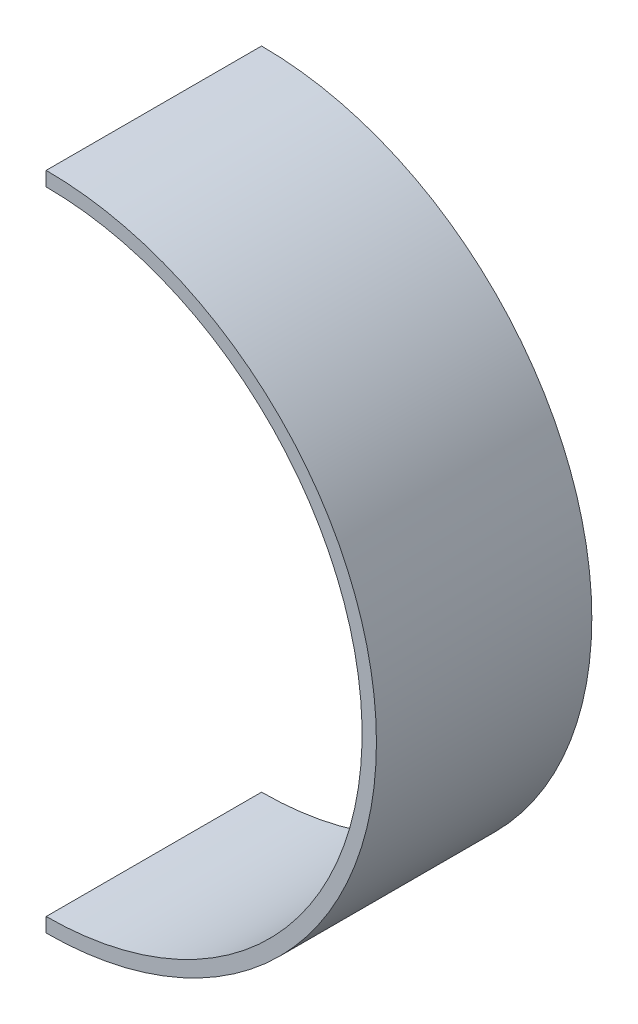
ISO-10303-21;
HEADER;
FILE_DESCRIPTION(('STEP AP214'),'2;1');
FILE_NAME('part.step','',(''),(''),'','','');
FILE_SCHEMA(('AUTOMOTIVE_DESIGN { 1 0 10303 214 1 1 1 1 }'));
ENDSEC;
DATA;
#1=APPLICATION_CONTEXT('core data for automotive mechanical design processes');
#2=APPLICATION_PROTOCOL_DEFINITION('international standard','automotive_design',2000,#1);
#3=PRODUCT_CONTEXT('',#1,'mechanical');
#4=PRODUCT('Part','Part','',(#3));
#5=PRODUCT_RELATED_PRODUCT_CATEGORY('part','',(#4));
#6=PRODUCT_DEFINITION_FORMATION('','',#4);
#7=PRODUCT_DEFINITION_CONTEXT('part definition',#1,'design');
#8=PRODUCT_DEFINITION('design','',#6,#7);
#9=PRODUCT_DEFINITION_SHAPE('','',#8);
#10=(LENGTH_UNIT() NAMED_UNIT(*) SI_UNIT(.MILLI.,.METRE.));
#11=(NAMED_UNIT(*) PLANE_ANGLE_UNIT() SI_UNIT($,.RADIAN.));
#12=(NAMED_UNIT(*) SI_UNIT($,.STERADIAN.) SOLID_ANGLE_UNIT());
#13=UNCERTAINTY_MEASURE_WITH_UNIT(LENGTH_MEASURE(1.E-05),#10,'distance_accuracy_value','');
#14=(GEOMETRIC_REPRESENTATION_CONTEXT(3) GLOBAL_UNCERTAINTY_ASSIGNED_CONTEXT((#13)) GLOBAL_UNIT_ASSIGNED_CONTEXT((#10,
#11,#12)) REPRESENTATION_CONTEXT('',''));
#15=CARTESIAN_POINT('',(0.,0.,0.));
#16=DIRECTION('',(0.,0.,1.));
#17=DIRECTION('',(1.,0.,0.));
#18=AXIS2_PLACEMENT_3D('',#15,#16,#17);
#19=CARTESIAN_POINT('',(0.,0.,15.));
#20=DIRECTION('',(0.,0.,1.));
#21=DIRECTION('',(1.,0.,0.));
#22=AXIS2_PLACEMENT_3D('',#19,#20,#21);
#23=PLANE('',#22);
#24=CARTESIAN_POINT('',(0.,-22.5,15.));
#25=DIRECTION('',(0.,0.,1.));
#26=DIRECTION('',(-1.,0.,0.));
#27=AXIS2_PLACEMENT_3D('',#24,#25,#26);
#28=CIRCLE('',#27,23.);
#29=CARTESIAN_POINT('',(0.,-45.5,15.));
#30=VERTEX_POINT('',#29);
#31=CARTESIAN_POINT('',(0.,0.499999999999997,15.));
#32=VERTEX_POINT('',#31);
#33=EDGE_CURVE('E73',#30,#32,#28,.T.);
#34=ORIENTED_EDGE('',*,*,#33,.T.);
#35=DIRECTION('',(0.,1.,0.));
#36=VECTOR('',#35,1.);
#37=CARTESIAN_POINT('',(0.,0.499999999999997,15.));
#38=LINE('',#37,#36);
#39=CARTESIAN_POINT('',(0.,-0.499999999999997,15.));
#40=VERTEX_POINT('',#39);
#41=EDGE_CURVE('E75',#40,#32,#38,.T.);
#42=ORIENTED_EDGE('',*,*,#41,.F.);
#43=CARTESIAN_POINT('',(0.,-22.5,15.));
#44=DIRECTION('',(0.,0.,-1.));
#45=DIRECTION('',(-1.,0.,0.));
#46=AXIS2_PLACEMENT_3D('',#43,#44,#45);
#47=CIRCLE('',#46,22.);
#48=CARTESIAN_POINT('',(0.,-44.5,15.));
#49=VERTEX_POINT('',#48);
#50=EDGE_CURVE('E60',#40,#49,#47,.T.);
#51=ORIENTED_EDGE('',*,*,#50,.T.);
#52=DIRECTION('',(0.,-1.,0.));
#53=VECTOR('',#52,1.);
#54=CARTESIAN_POINT('',(0.,-44.5,15.));
#55=LINE('',#54,#53);
#56=EDGE_CURVE('E77',#49,#30,#55,.T.);
#57=ORIENTED_EDGE('',*,*,#56,.T.);
#58=EDGE_LOOP('',(#34,#42,#51,#57));
#59=FACE_BOUND('',#58,.T.);
#60=ADVANCED_FACE('F33',(#59),#23,.T.);
#61=CARTESIAN_POINT('',(0.,0.,0.));
#62=DIRECTION('',(0.,0.,1.));
#63=DIRECTION('',(1.,0.,0.));
#64=AXIS2_PLACEMENT_3D('',#61,#62,#63);
#65=PLANE('',#64);
#66=DIRECTION('',(0.,1.,0.));
#67=VECTOR('',#66,1.);
#68=CARTESIAN_POINT('',(0.,0.499999999999997,0.));
#69=LINE('',#68,#67);
#70=CARTESIAN_POINT('',(0.,-0.499999999999997,0.));
#71=VERTEX_POINT('',#70);
#72=CARTESIAN_POINT('',(0.,0.499999999999997,0.));
#73=VERTEX_POINT('',#72);
#74=EDGE_CURVE('E89',#71,#73,#69,.T.);
#75=ORIENTED_EDGE('',*,*,#74,.T.);
#76=CARTESIAN_POINT('',(0.,-22.5,0.));
#77=DIRECTION('',(0.,0.,1.));
#78=DIRECTION('',(-1.,0.,0.));
#79=AXIS2_PLACEMENT_3D('',#76,#77,#78);
#80=CIRCLE('',#79,23.);
#81=CARTESIAN_POINT('',(0.,-45.5,0.));
#82=VERTEX_POINT('',#81);
#83=EDGE_CURVE('E65',#82,#73,#80,.T.);
#84=ORIENTED_EDGE('',*,*,#83,.F.);
#85=DIRECTION('',(0.,-1.,0.));
#86=VECTOR('',#85,1.);
#87=CARTESIAN_POINT('',(0.,-44.5,0.));
#88=LINE('',#87,#86);
#89=CARTESIAN_POINT('',(0.,-44.5,0.));
#90=VERTEX_POINT('',#89);
#91=EDGE_CURVE('E97',#90,#82,#88,.T.);
#92=ORIENTED_EDGE('',*,*,#91,.F.);
#93=CARTESIAN_POINT('',(0.,-22.5,0.));
#94=DIRECTION('',(0.,0.,-1.));
#95=DIRECTION('',(-1.,0.,0.));
#96=AXIS2_PLACEMENT_3D('',#93,#94,#95);
#97=CIRCLE('',#96,22.);
#98=EDGE_CURVE('E95',#71,#90,#97,.T.);
#99=ORIENTED_EDGE('',*,*,#98,.F.);
#100=EDGE_LOOP('',(#75,#84,#92,#99));
#101=FACE_BOUND('',#100,.T.);
#102=ADVANCED_FACE('F35',(#101),#65,.F.);
#103=CARTESIAN_POINT('',(0.,-22.5,0.));
#104=DIRECTION('',(0.,0.,1.));
#105=DIRECTION('',(1.,0.,0.));
#106=AXIS2_PLACEMENT_3D('',#103,#104,#105);
#107=CYLINDRICAL_SURFACE('',#106,23.);
#108=ORIENTED_EDGE('',*,*,#83,.T.);
#109=DIRECTION('',(0.,0.,1.));
#110=VECTOR('',#109,1.);
#111=CARTESIAN_POINT('',(0.,0.499999999999997,0.));
#112=LINE('',#111,#110);
#113=EDGE_CURVE('E78',#73,#32,#112,.T.);
#114=ORIENTED_EDGE('',*,*,#113,.T.);
#115=ORIENTED_EDGE('',*,*,#33,.F.);
#116=DIRECTION('',(0.,0.,1.));
#117=VECTOR('',#116,1.);
#118=CARTESIAN_POINT('',(0.,-45.5,0.));
#119=LINE('',#118,#117);
#120=EDGE_CURVE('E11',#82,#30,#119,.T.);
#121=ORIENTED_EDGE('',*,*,#120,.F.);
#122=EDGE_LOOP('',(#108,#114,#115,#121));
#123=FACE_BOUND('',#122,.T.);
#124=ADVANCED_FACE('F80',(#123),#107,.T.);
#125=CARTESIAN_POINT('',(0.,-22.5,0.));
#126=DIRECTION('',(0.,0.,1.));
#127=DIRECTION('',(1.,0.,0.));
#128=AXIS2_PLACEMENT_3D('',#125,#126,#127);
#129=CYLINDRICAL_SURFACE('',#128,22.);
#130=ORIENTED_EDGE('',*,*,#50,.F.);
#131=DIRECTION('',(0.,0.,1.));
#132=VECTOR('',#131,1.);
#133=CARTESIAN_POINT('',(0.,-0.499999999999997,0.));
#134=LINE('',#133,#132);
#135=EDGE_CURVE('E84',#71,#40,#134,.T.);
#136=ORIENTED_EDGE('',*,*,#135,.F.);
#137=ORIENTED_EDGE('',*,*,#98,.T.);
#138=DIRECTION('',(0.,0.,1.));
#139=VECTOR('',#138,1.);
#140=CARTESIAN_POINT('',(0.,-44.5,0.));
#141=LINE('',#140,#139);
#142=EDGE_CURVE('E37',#90,#49,#141,.T.);
#143=ORIENTED_EDGE('',*,*,#142,.T.);
#144=EDGE_LOOP('',(#130,#136,#137,#143));
#145=FACE_BOUND('',#144,.T.);
#146=ADVANCED_FACE('F105',(#145),#129,.F.);
#147=CARTESIAN_POINT('',(0.,-44.5,0.));
#148=DIRECTION('',(-1.,0.,0.));
#149=DIRECTION('',(0.,-1.,0.));
#150=AXIS2_PLACEMENT_3D('',#147,#148,#149);
#151=PLANE('',#150);
#152=ORIENTED_EDGE('',*,*,#56,.F.);
#153=ORIENTED_EDGE('',*,*,#142,.F.);
#154=ORIENTED_EDGE('',*,*,#91,.T.);
#155=ORIENTED_EDGE('',*,*,#120,.T.);
#156=EDGE_LOOP('',(#152,#153,#154,#155));
#157=FACE_BOUND('',#156,.T.);
#158=ADVANCED_FACE('F106',(#157),#151,.T.);
#159=CARTESIAN_POINT('',(0.,0.499999999999997,0.));
#160=DIRECTION('',(1.,0.,0.));
#161=DIRECTION('',(0.,1.,0.));
#162=AXIS2_PLACEMENT_3D('',#159,#160,#161);
#163=PLANE('',#162);
#164=ORIENTED_EDGE('',*,*,#41,.T.);
#165=ORIENTED_EDGE('',*,*,#113,.F.);
#166=ORIENTED_EDGE('',*,*,#74,.F.);
#167=ORIENTED_EDGE('',*,*,#135,.T.);
#168=EDGE_LOOP('',(#164,#165,#166,#167));
#169=FACE_BOUND('',#168,.T.);
#170=ADVANCED_FACE('F87',(#169),#163,.F.);
#171=CLOSED_SHELL('',(#60,#102,#124,#146,#158,#170));
#172=MANIFOLD_SOLID_BREP('B2',#171);
#173=ADVANCED_BREP_SHAPE_REPRESENTATION('',(#18,#172),#14);
#174=SHAPE_DEFINITION_REPRESENTATION(#9,#173);
ENDSEC;
END-ISO-10303-21;
